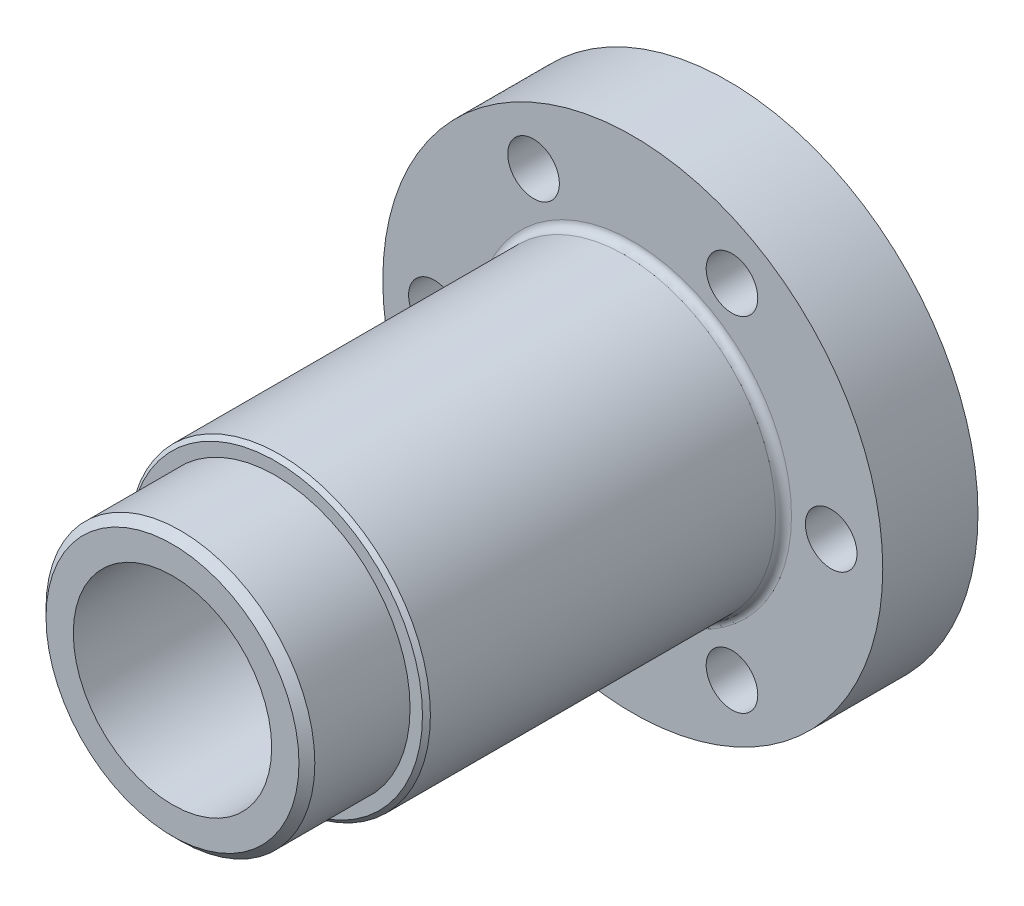
ISO-10303-21;
HEADER;
FILE_DESCRIPTION(('STEP AP214'),'2;1');
FILE_NAME('part.step','',(''),(''),'','','');
FILE_SCHEMA(('AUTOMOTIVE_DESIGN { 1 0 10303 214 1 1 1 1 }'));
ENDSEC;
DATA;
#1=APPLICATION_CONTEXT('core data for automotive mechanical design processes');
#2=APPLICATION_PROTOCOL_DEFINITION('international standard','automotive_design',2000,#1);
#3=PRODUCT_CONTEXT('',#1,'mechanical');
#4=PRODUCT('Part','Part','',(#3));
#5=PRODUCT_RELATED_PRODUCT_CATEGORY('part','',(#4));
#6=PRODUCT_DEFINITION_FORMATION('','',#4);
#7=PRODUCT_DEFINITION_CONTEXT('part definition',#1,'design');
#8=PRODUCT_DEFINITION('design','',#6,#7);
#9=PRODUCT_DEFINITION_SHAPE('','',#8);
#10=(LENGTH_UNIT() NAMED_UNIT(*) SI_UNIT(.MILLI.,.METRE.));
#11=(NAMED_UNIT(*) PLANE_ANGLE_UNIT() SI_UNIT($,.RADIAN.));
#12=(NAMED_UNIT(*) SI_UNIT($,.STERADIAN.) SOLID_ANGLE_UNIT());
#13=UNCERTAINTY_MEASURE_WITH_UNIT(LENGTH_MEASURE(1.E-05),#10,'distance_accuracy_value','');
#14=(GEOMETRIC_REPRESENTATION_CONTEXT(3) GLOBAL_UNCERTAINTY_ASSIGNED_CONTEXT((#13)) GLOBAL_UNIT_ASSIGNED_CONTEXT((#10,
#11,#12)) REPRESENTATION_CONTEXT('',''));
#15=CARTESIAN_POINT('',(0.,0.,0.));
#16=DIRECTION('',(0.,0.,1.));
#17=DIRECTION('',(1.,0.,0.));
#18=AXIS2_PLACEMENT_3D('',#15,#16,#17);
#19=CARTESIAN_POINT('',(0.,0.,57.));
#20=DIRECTION('',(0.,0.,1.));
#21=DIRECTION('',(1.,0.,0.));
#22=AXIS2_PLACEMENT_3D('',#19,#20,#21);
#23=PLANE('',#22);
#24=CARTESIAN_POINT('',(0.,0.,57.));
#25=DIRECTION('',(0.,0.,1.));
#26=DIRECTION('',(1.,0.,0.));
#27=AXIS2_PLACEMENT_3D('',#24,#25,#26);
#28=CIRCLE('',#27,18.5000000000001);
#29=CARTESIAN_POINT('',(18.5000000000001,0.,57.));
#30=VERTEX_POINT('',#29);
#31=EDGE_CURVE('E107',#30,#30,#28,.T.);
#32=ORIENTED_EDGE('',*,*,#31,.T.);
#33=EDGE_LOOP('',(#32));
#34=FACE_BOUND('',#33,.T.);
#35=CARTESIAN_POINT('',(0.,0.,57.));
#36=DIRECTION('',(0.,0.,1.));
#37=DIRECTION('',(1.,0.,0.));
#38=AXIS2_PLACEMENT_3D('',#35,#36,#37);
#39=CIRCLE('',#38,16.9375);
#40=CARTESIAN_POINT('',(16.9375,0.,57.));
#41=VERTEX_POINT('',#40);
#42=EDGE_CURVE('E54',#41,#41,#39,.T.);
#43=ORIENTED_EDGE('',*,*,#42,.F.);
#44=EDGE_LOOP('',(#43));
#45=FACE_BOUND('',#44,.T.);
#46=ADVANCED_FACE('F35',(#34,#45),#23,.T.);
#47=CARTESIAN_POINT('',(0.,0.,12.));
#48=DIRECTION('',(0.,0.,1.));
#49=DIRECTION('',(1.,0.,0.));
#50=AXIS2_PLACEMENT_3D('',#47,#48,#49);
#51=PLANE('',#50);
#52=CARTESIAN_POINT('',(0.,0.,12.));
#53=DIRECTION('',(0.,0.,1.));
#54=DIRECTION('',(1.,0.,0.));
#55=AXIS2_PLACEMENT_3D('',#52,#53,#54);
#56=CIRCLE('',#55,20.);
#57=CARTESIAN_POINT('',(20.,0.,12.));
#58=VERTEX_POINT('',#57);
#59=EDGE_CURVE('E116',#58,#58,#56,.F.);
#60=ORIENTED_EDGE('',*,*,#59,.T.);
#61=EDGE_LOOP('',(#60));
#62=FACE_BOUND('',#61,.T.);
#63=CARTESIAN_POINT('',(0.,0.,12.));
#64=DIRECTION('',(0.,0.,1.));
#65=DIRECTION('',(1.,0.,0.));
#66=AXIS2_PLACEMENT_3D('',#63,#64,#65);
#67=CIRCLE('',#66,31.5);
#68=CARTESIAN_POINT('',(31.5,0.,12.));
#69=VERTEX_POINT('',#68);
#70=EDGE_CURVE('E99',#69,#69,#67,.T.);
#71=ORIENTED_EDGE('',*,*,#70,.T.);
#72=EDGE_LOOP('',(#71));
#73=FACE_BOUND('',#72,.T.);
#74=CARTESIAN_POINT('',(12.5000000000001,21.6506350946123,12.));
#75=DIRECTION('',(0.,0.,1.));
#76=DIRECTION('',(1.,0.,0.));
#77=AXIS2_PLACEMENT_3D('',#74,#75,#76);
#78=CIRCLE('',#77,3.25);
#79=CARTESIAN_POINT('',(15.7500000000001,21.6506350946123,12.));
#80=VERTEX_POINT('',#79);
#81=EDGE_CURVE('E92',#80,#80,#78,.T.);
#82=ORIENTED_EDGE('',*,*,#81,.F.);
#83=EDGE_LOOP('',(#82));
#84=FACE_BOUND('',#83,.T.);
#85=CARTESIAN_POINT('',(25.0000000000012,1.9798051400989E-12,12.));
#86=DIRECTION('',(0.,0.,1.));
#87=DIRECTION('',(1.,0.,0.));
#88=AXIS2_PLACEMENT_3D('',#85,#86,#87);
#89=CIRCLE('',#88,3.25);
#90=CARTESIAN_POINT('',(28.2500000000012,1.9798051400989E-12,12.));
#91=VERTEX_POINT('',#90);
#92=EDGE_CURVE('E86',#91,#91,#89,.T.);
#93=ORIENTED_EDGE('',*,*,#92,.F.);
#94=EDGE_LOOP('',(#93));
#95=FACE_BOUND('',#94,.T.);
#96=CARTESIAN_POINT('',(12.5000000000023,-21.6506350946096,12.));
#97=DIRECTION('',(0.,0.,1.));
#98=DIRECTION('',(1.,0.,0.));
#99=AXIS2_PLACEMENT_3D('',#96,#97,#98);
#100=CIRCLE('',#99,3.25);
#101=CARTESIAN_POINT('',(15.7500000000023,-21.6506350946096,12.));
#102=VERTEX_POINT('',#101);
#103=EDGE_CURVE('E80',#102,#102,#100,.T.);
#104=ORIENTED_EDGE('',*,*,#103,.F.);
#105=EDGE_LOOP('',(#104));
#106=FACE_BOUND('',#105,.T.);
#107=CARTESIAN_POINT('',(-12.4999999999977,-21.6506350946109,12.));
#108=DIRECTION('',(0.,0.,1.));
#109=DIRECTION('',(1.,0.,0.));
#110=AXIS2_PLACEMENT_3D('',#107,#108,#109);
#111=CIRCLE('',#110,3.25);
#112=CARTESIAN_POINT('',(-9.24999999999767,-21.6506350946109,12.));
#113=VERTEX_POINT('',#112);
#114=EDGE_CURVE('E74',#113,#113,#111,.T.);
#115=ORIENTED_EDGE('',*,*,#114,.F.);
#116=EDGE_LOOP('',(#115));
#117=FACE_BOUND('',#116,.T.);
#118=CARTESIAN_POINT('',(-24.9999999999988,-5.57995744016358E-13,12.));
#119=DIRECTION('',(0.,0.,1.));
#120=DIRECTION('',(1.,0.,0.));
#121=AXIS2_PLACEMENT_3D('',#118,#119,#120);
#122=CIRCLE('',#121,3.25);
#123=CARTESIAN_POINT('',(-21.7499999999988,-5.57995744016358E-13,12.));
#124=VERTEX_POINT('',#123);
#125=EDGE_CURVE('E68',#124,#124,#122,.T.);
#126=ORIENTED_EDGE('',*,*,#125,.F.);
#127=EDGE_LOOP('',(#126));
#128=FACE_BOUND('',#127,.T.);
#129=CARTESIAN_POINT('',(-12.4999999999999,21.650635094611,12.));
#130=DIRECTION('',(0.,0.,1.));
#131=DIRECTION('',(1.,0.,0.));
#132=AXIS2_PLACEMENT_3D('',#129,#130,#131);
#133=CIRCLE('',#132,3.25);
#134=CARTESIAN_POINT('',(-9.24999999999988,21.650635094611,12.));
#135=VERTEX_POINT('',#134);
#136=EDGE_CURVE('E58',#135,#135,#133,.T.);
#137=ORIENTED_EDGE('',*,*,#136,.F.);
#138=EDGE_LOOP('',(#137));
#139=FACE_BOUND('',#138,.T.);
#140=ADVANCED_FACE('F139',(#62,#73,#84,#95,#106,#117,#128,#139),#51,.T.);
#141=CARTESIAN_POINT('',(0.,0.,0.));
#142=DIRECTION('',(0.,0.,1.));
#143=DIRECTION('',(1.,0.,0.));
#144=AXIS2_PLACEMENT_3D('',#141,#142,#143);
#145=PLANE('',#144);
#146=CARTESIAN_POINT('',(-12.4999999999999,21.650635094611,0.));
#147=DIRECTION('',(0.,0.,1.));
#148=DIRECTION('',(1.,0.,0.));
#149=AXIS2_PLACEMENT_3D('',#146,#147,#148);
#150=CIRCLE('',#149,3.25);
#151=CARTESIAN_POINT('',(-9.24999999999988,21.650635094611,0.));
#152=VERTEX_POINT('',#151);
#153=EDGE_CURVE('E65',#152,#152,#150,.T.);
#154=ORIENTED_EDGE('',*,*,#153,.T.);
#155=EDGE_LOOP('',(#154));
#156=FACE_BOUND('',#155,.T.);
#157=CARTESIAN_POINT('',(-24.9999999999988,-5.57995744016358E-13,0.));
#158=DIRECTION('',(0.,0.,1.));
#159=DIRECTION('',(1.,0.,0.));
#160=AXIS2_PLACEMENT_3D('',#157,#158,#159);
#161=CIRCLE('',#160,3.25);
#162=CARTESIAN_POINT('',(-21.7499999999988,-5.57995744016358E-13,0.));
#163=VERTEX_POINT('',#162);
#164=EDGE_CURVE('E71',#163,#163,#161,.T.);
#165=ORIENTED_EDGE('',*,*,#164,.T.);
#166=EDGE_LOOP('',(#165));
#167=FACE_BOUND('',#166,.T.);
#168=CARTESIAN_POINT('',(-12.4999999999977,-21.6506350946109,0.));
#169=DIRECTION('',(0.,0.,1.));
#170=DIRECTION('',(1.,0.,0.));
#171=AXIS2_PLACEMENT_3D('',#168,#169,#170);
#172=CIRCLE('',#171,3.25);
#173=CARTESIAN_POINT('',(-9.24999999999767,-21.6506350946109,0.));
#174=VERTEX_POINT('',#173);
#175=EDGE_CURVE('E77',#174,#174,#172,.T.);
#176=ORIENTED_EDGE('',*,*,#175,.T.);
#177=EDGE_LOOP('',(#176));
#178=FACE_BOUND('',#177,.T.);
#179=CARTESIAN_POINT('',(12.5000000000023,-21.6506350946096,0.));
#180=DIRECTION('',(0.,0.,1.));
#181=DIRECTION('',(1.,0.,0.));
#182=AXIS2_PLACEMENT_3D('',#179,#180,#181);
#183=CIRCLE('',#182,3.25);
#184=CARTESIAN_POINT('',(15.7500000000023,-21.6506350946096,0.));
#185=VERTEX_POINT('',#184);
#186=EDGE_CURVE('E83',#185,#185,#183,.T.);
#187=ORIENTED_EDGE('',*,*,#186,.T.);
#188=EDGE_LOOP('',(#187));
#189=FACE_BOUND('',#188,.T.);
#190=CARTESIAN_POINT('',(25.0000000000012,1.9798051400989E-12,0.));
#191=DIRECTION('',(0.,0.,1.));
#192=DIRECTION('',(1.,0.,0.));
#193=AXIS2_PLACEMENT_3D('',#190,#191,#192);
#194=CIRCLE('',#193,3.25);
#195=CARTESIAN_POINT('',(28.2500000000012,1.9798051400989E-12,0.));
#196=VERTEX_POINT('',#195);
#197=EDGE_CURVE('E89',#196,#196,#194,.T.);
#198=ORIENTED_EDGE('',*,*,#197,.T.);
#199=EDGE_LOOP('',(#198));
#200=FACE_BOUND('',#199,.T.);
#201=CARTESIAN_POINT('',(12.5000000000001,21.6506350946123,0.));
#202=DIRECTION('',(0.,0.,1.));
#203=DIRECTION('',(1.,0.,0.));
#204=AXIS2_PLACEMENT_3D('',#201,#202,#203);
#205=CIRCLE('',#204,3.25);
#206=CARTESIAN_POINT('',(15.7500000000001,21.6506350946123,0.));
#207=VERTEX_POINT('',#206);
#208=EDGE_CURVE('E95',#207,#207,#205,.T.);
#209=ORIENTED_EDGE('',*,*,#208,.T.);
#210=EDGE_LOOP('',(#209));
#211=FACE_BOUND('',#210,.T.);
#212=CARTESIAN_POINT('',(0.,0.,0.));
#213=DIRECTION('',(0.,0.,1.));
#214=DIRECTION('',(1.,0.,0.));
#215=AXIS2_PLACEMENT_3D('',#212,#213,#214);
#216=CIRCLE('',#215,31.5);
#217=CARTESIAN_POINT('',(31.5,0.,0.));
#218=VERTEX_POINT('',#217);
#219=EDGE_CURVE('E98',#218,#218,#216,.T.);
#220=ORIENTED_EDGE('',*,*,#219,.F.);
#221=EDGE_LOOP('',(#220));
#222=FACE_BOUND('',#221,.T.);
#223=CARTESIAN_POINT('',(0.,0.,0.));
#224=DIRECTION('',(0.,0.,1.));
#225=DIRECTION('',(1.,0.,0.));
#226=AXIS2_PLACEMENT_3D('',#223,#224,#225);
#227=CIRCLE('',#226,15.75);
#228=CARTESIAN_POINT('',(15.75,0.,0.));
#229=VERTEX_POINT('',#228);
#230=EDGE_CURVE('E102',#229,#229,#227,.F.);
#231=ORIENTED_EDGE('',*,*,#230,.F.);
#232=EDGE_LOOP('',(#231));
#233=FACE_BOUND('',#232,.T.);
#234=ADVANCED_FACE('F145',(#156,#167,#178,#189,#200,#211,#222,#233),#145,.F.);
#235=CARTESIAN_POINT('',(0.,0.,12.));
#236=DIRECTION('',(0.,0.,-1.));
#237=DIRECTION('',(-1.,0.,0.));
#238=AXIS2_PLACEMENT_3D('',#235,#236,#237);
#239=CYLINDRICAL_SURFACE('',#238,31.5);
#240=ORIENTED_EDGE('',*,*,#70,.F.);
#241=EDGE_LOOP('',(#240));
#242=FACE_BOUND('',#241,.T.);
#243=ORIENTED_EDGE('',*,*,#219,.T.);
#244=EDGE_LOOP('',(#243));
#245=FACE_BOUND('',#244,.T.);
#246=ADVANCED_FACE('F186',(#242,#245),#239,.T.);
#247=CARTESIAN_POINT('',(0.,0.,-6.));
#248=DIRECTION('',(0.,0.,1.));
#249=DIRECTION('',(1.,0.,0.));
#250=AXIS2_PLACEMENT_3D('',#247,#248,#249);
#251=CYLINDRICAL_SURFACE('',#250,15.75);
#252=CARTESIAN_POINT('',(0.,0.,-5.50000000000002));
#253=DIRECTION('',(0.,0.,-1.));
#254=DIRECTION('',(-1.,0.,0.));
#255=AXIS2_PLACEMENT_3D('',#252,#253,#254);
#256=CIRCLE('',#255,15.75);
#257=CARTESIAN_POINT('',(-15.75,0.,-5.50000000000002));
#258=VERTEX_POINT('',#257);
#259=EDGE_CURVE('E11',#258,#258,#256,.F.);
#260=ORIENTED_EDGE('',*,*,#259,.T.);
#261=EDGE_LOOP('',(#260));
#262=FACE_BOUND('',#261,.T.);
#263=ORIENTED_EDGE('',*,*,#230,.T.);
#264=EDGE_LOOP('',(#263));
#265=FACE_BOUND('',#264,.T.);
#266=ADVANCED_FACE('F184',(#262,#265),#251,.T.);
#267=CARTESIAN_POINT('',(0.,0.,-6.));
#268=DIRECTION('',(0.,0.,-1.));
#269=DIRECTION('',(-1.,0.,0.));
#270=AXIS2_PLACEMENT_3D('',#267,#268,#269);
#271=PLANE('',#270);
#272=CARTESIAN_POINT('',(0.,0.,-6.));
#273=DIRECTION('',(0.,0.,-1.));
#274=DIRECTION('',(-1.,0.,0.));
#275=AXIS2_PLACEMENT_3D('',#272,#273,#274);
#276=CIRCLE('',#275,15.25);
#277=CARTESIAN_POINT('',(-15.25,0.,-6.));
#278=VERTEX_POINT('',#277);
#279=EDGE_CURVE('E42',#278,#278,#276,.T.);
#280=ORIENTED_EDGE('',*,*,#279,.T.);
#281=EDGE_LOOP('',(#280));
#282=FACE_BOUND('',#281,.T.);
#283=ADVANCED_FACE('F127',(#282),#271,.T.);
#284=CARTESIAN_POINT('',(12.5000000000001,21.6506350946123,12.));
#285=DIRECTION('',(0.,0.,1.));
#286=DIRECTION('',(1.,0.,0.));
#287=AXIS2_PLACEMENT_3D('',#284,#285,#286);
#288=CYLINDRICAL_SURFACE('',#287,3.25);
#289=ORIENTED_EDGE('',*,*,#81,.T.);
#290=EDGE_LOOP('',(#289));
#291=FACE_BOUND('',#290,.T.);
#292=ORIENTED_EDGE('',*,*,#208,.F.);
#293=EDGE_LOOP('',(#292));
#294=FACE_BOUND('',#293,.T.);
#295=ADVANCED_FACE('F177',(#291,#294),#288,.F.);
#296=CARTESIAN_POINT('',(25.0000000000012,1.9798051400989E-12,12.));
#297=DIRECTION('',(0.,0.,1.));
#298=DIRECTION('',(1.,0.,0.));
#299=AXIS2_PLACEMENT_3D('',#296,#297,#298);
#300=CYLINDRICAL_SURFACE('',#299,3.25);
#301=ORIENTED_EDGE('',*,*,#92,.T.);
#302=EDGE_LOOP('',(#301));
#303=FACE_BOUND('',#302,.T.);
#304=ORIENTED_EDGE('',*,*,#197,.F.);
#305=EDGE_LOOP('',(#304));
#306=FACE_BOUND('',#305,.T.);
#307=ADVANCED_FACE('F173',(#303,#306),#300,.F.);
#308=CARTESIAN_POINT('',(12.5000000000023,-21.6506350946096,12.));
#309=DIRECTION('',(0.,0.,1.));
#310=DIRECTION('',(1.,0.,0.));
#311=AXIS2_PLACEMENT_3D('',#308,#309,#310);
#312=CYLINDRICAL_SURFACE('',#311,3.25);
#313=ORIENTED_EDGE('',*,*,#103,.T.);
#314=EDGE_LOOP('',(#313));
#315=FACE_BOUND('',#314,.T.);
#316=ORIENTED_EDGE('',*,*,#186,.F.);
#317=EDGE_LOOP('',(#316));
#318=FACE_BOUND('',#317,.T.);
#319=ADVANCED_FACE('F169',(#315,#318),#312,.F.);
#320=CARTESIAN_POINT('',(-12.4999999999977,-21.6506350946109,12.));
#321=DIRECTION('',(0.,0.,1.));
#322=DIRECTION('',(1.,0.,0.));
#323=AXIS2_PLACEMENT_3D('',#320,#321,#322);
#324=CYLINDRICAL_SURFACE('',#323,3.25);
#325=ORIENTED_EDGE('',*,*,#114,.T.);
#326=EDGE_LOOP('',(#325));
#327=FACE_BOUND('',#326,.T.);
#328=ORIENTED_EDGE('',*,*,#175,.F.);
#329=EDGE_LOOP('',(#328));
#330=FACE_BOUND('',#329,.T.);
#331=ADVANCED_FACE('F165',(#327,#330),#324,.F.);
#332=CARTESIAN_POINT('',(-24.9999999999988,-5.57995744016358E-13,12.));
#333=DIRECTION('',(0.,0.,1.));
#334=DIRECTION('',(1.,0.,0.));
#335=AXIS2_PLACEMENT_3D('',#332,#333,#334);
#336=CYLINDRICAL_SURFACE('',#335,3.25);
#337=ORIENTED_EDGE('',*,*,#125,.T.);
#338=EDGE_LOOP('',(#337));
#339=FACE_BOUND('',#338,.T.);
#340=ORIENTED_EDGE('',*,*,#164,.F.);
#341=EDGE_LOOP('',(#340));
#342=FACE_BOUND('',#341,.T.);
#343=ADVANCED_FACE('F161',(#339,#342),#336,.F.);
#344=CARTESIAN_POINT('',(-12.4999999999999,21.650635094611,12.));
#345=DIRECTION('',(0.,0.,1.));
#346=DIRECTION('',(1.,0.,0.));
#347=AXIS2_PLACEMENT_3D('',#344,#345,#346);
#348=CYLINDRICAL_SURFACE('',#347,3.25);
#349=ORIENTED_EDGE('',*,*,#136,.T.);
#350=EDGE_LOOP('',(#349));
#351=FACE_BOUND('',#350,.T.);
#352=ORIENTED_EDGE('',*,*,#153,.F.);
#353=EDGE_LOOP('',(#352));
#354=FACE_BOUND('',#353,.T.);
#355=ADVANCED_FACE('F157',(#351,#354),#348,.F.);
#356=CARTESIAN_POINT('',(0.,0.,57.));
#357=DIRECTION('',(0.,0.,-1.));
#358=DIRECTION('',(-1.,0.,0.));
#359=AXIS2_PLACEMENT_3D('',#356,#357,#358);
#360=CYLINDRICAL_SURFACE('',#359,19.);
#361=CARTESIAN_POINT('',(0.,0.,13.));
#362=DIRECTION('',(0.,0.,1.));
#363=DIRECTION('',(1.,0.,0.));
#364=AXIS2_PLACEMENT_3D('',#361,#362,#363);
#365=CIRCLE('',#364,19.);
#366=CARTESIAN_POINT('',(19.,0.,13.));
#367=VERTEX_POINT('',#366);
#368=EDGE_CURVE('E113',#367,#367,#365,.T.);
#369=ORIENTED_EDGE('',*,*,#368,.T.);
#370=EDGE_LOOP('',(#369));
#371=FACE_BOUND('',#370,.T.);
#372=CARTESIAN_POINT('',(0.,0.,56.5000000000001));
#373=DIRECTION('',(0.,0.,1.));
#374=DIRECTION('',(1.,0.,0.));
#375=AXIS2_PLACEMENT_3D('',#372,#373,#374);
#376=CIRCLE('',#375,19.);
#377=CARTESIAN_POINT('',(19.,0.,56.5000000000001));
#378=VERTEX_POINT('',#377);
#379=EDGE_CURVE('E110',#378,#378,#376,.F.);
#380=ORIENTED_EDGE('',*,*,#379,.T.);
#381=EDGE_LOOP('',(#380));
#382=FACE_BOUND('',#381,.T.);
#383=ADVANCED_FACE('F153',(#371,#382),#360,.T.);
#384=CARTESIAN_POINT('',(0.,0.,57.));
#385=DIRECTION('',(0.,0.,-1.));
#386=DIRECTION('',(-1.,0.,0.));
#387=AXIS2_PLACEMENT_3D('',#384,#385,#386);
#388=CONICAL_SURFACE('',#387,18.5000000000001,0.785398163397448);
#389=ORIENTED_EDGE('',*,*,#379,.F.);
#390=EDGE_LOOP('',(#389));
#391=FACE_BOUND('',#390,.T.);
#392=ORIENTED_EDGE('',*,*,#31,.F.);
#393=EDGE_LOOP('',(#392));
#394=FACE_BOUND('',#393,.T.);
#395=ADVANCED_FACE('F156',(#391,#394),#388,.T.);
#396=CARTESIAN_POINT('',(0.,0.,13.));
#397=DIRECTION('',(0.,0.,1.));
#398=DIRECTION('',(1.,0.,0.));
#399=AXIS2_PLACEMENT_3D('',#396,#397,#398);
#400=TOROIDAL_SURFACE('',#399,20.,1.);
#401=ORIENTED_EDGE('',*,*,#59,.F.);
#402=EDGE_LOOP('',(#401));
#403=FACE_BOUND('',#402,.T.);
#404=ORIENTED_EDGE('',*,*,#368,.F.);
#405=EDGE_LOOP('',(#404));
#406=FACE_BOUND('',#405,.T.);
#407=ADVANCED_FACE('F197',(#403,#406),#400,.F.);
#408=CARTESIAN_POINT('',(0.,0.,70.));
#409=DIRECTION('',(0.,0.,-1.));
#410=DIRECTION('',(-1.,0.,0.));
#411=AXIS2_PLACEMENT_3D('',#408,#409,#410);
#412=CYLINDRICAL_SURFACE('',#411,16.9375);
#413=CARTESIAN_POINT('',(0.,0.,69.));
#414=DIRECTION('',(0.,0.,1.));
#415=DIRECTION('',(1.,0.,0.));
#416=AXIS2_PLACEMENT_3D('',#413,#414,#415);
#417=CIRCLE('',#416,16.9375);
#418=CARTESIAN_POINT('',(16.9375,0.,69.));
#419=VERTEX_POINT('',#418);
#420=EDGE_CURVE('E122',#419,#419,#417,.F.);
#421=ORIENTED_EDGE('',*,*,#420,.T.);
#422=EDGE_LOOP('',(#421));
#423=FACE_BOUND('',#422,.T.);
#424=ORIENTED_EDGE('',*,*,#42,.T.);
#425=EDGE_LOOP('',(#424));
#426=FACE_BOUND('',#425,.T.);
#427=ADVANCED_FACE('F151',(#423,#426),#412,.T.);
#428=CARTESIAN_POINT('',(0.,0.,70.));
#429=DIRECTION('',(0.,0.,1.));
#430=DIRECTION('',(1.,0.,0.));
#431=AXIS2_PLACEMENT_3D('',#428,#429,#430);
#432=PLANE('',#431);
#433=CARTESIAN_POINT('',(0.,0.,70.));
#434=DIRECTION('',(0.,0.,1.));
#435=DIRECTION('',(1.,0.,0.));
#436=AXIS2_PLACEMENT_3D('',#433,#434,#435);
#437=CIRCLE('',#436,12.5);
#438=CARTESIAN_POINT('',(12.5,0.,70.));
#439=VERTEX_POINT('',#438);
#440=EDGE_CURVE('E55',#439,#439,#437,.T.);
#441=ORIENTED_EDGE('',*,*,#440,.F.);
#442=EDGE_LOOP('',(#441));
#443=FACE_BOUND('',#442,.T.);
#444=CARTESIAN_POINT('',(0.,0.,70.));
#445=DIRECTION('',(0.,0.,1.));
#446=DIRECTION('',(1.,0.,0.));
#447=AXIS2_PLACEMENT_3D('',#444,#445,#446);
#448=CIRCLE('',#447,15.9375);
#449=CARTESIAN_POINT('',(15.9375,0.,70.));
#450=VERTEX_POINT('',#449);
#451=EDGE_CURVE('E119',#450,#450,#448,.T.);
#452=ORIENTED_EDGE('',*,*,#451,.T.);
#453=EDGE_LOOP('',(#452));
#454=FACE_BOUND('',#453,.T.);
#455=ADVANCED_FACE('F135',(#443,#454),#432,.T.);
#456=CARTESIAN_POINT('',(0.,0.,70.));
#457=DIRECTION('',(0.,0.,-1.));
#458=DIRECTION('',(-1.,0.,0.));
#459=AXIS2_PLACEMENT_3D('',#456,#457,#458);
#460=CONICAL_SURFACE('',#459,15.9375,0.785398163397445);
#461=ORIENTED_EDGE('',*,*,#420,.F.);
#462=EDGE_LOOP('',(#461));
#463=FACE_BOUND('',#462,.T.);
#464=ORIENTED_EDGE('',*,*,#451,.F.);
#465=EDGE_LOOP('',(#464));
#466=FACE_BOUND('',#465,.T.);
#467=ADVANCED_FACE('F130',(#463,#466),#460,.T.);
#468=CARTESIAN_POINT('',(0.,0.,-6.));
#469=DIRECTION('',(0.,0.,1.));
#470=DIRECTION('',(1.,0.,0.));
#471=AXIS2_PLACEMENT_3D('',#468,#469,#470);
#472=CONICAL_SURFACE('',#471,15.25,0.785398163397452);
#473=ORIENTED_EDGE('',*,*,#259,.F.);
#474=EDGE_LOOP('',(#473));
#475=FACE_BOUND('',#474,.T.);
#476=ORIENTED_EDGE('',*,*,#279,.F.);
#477=EDGE_LOOP('',(#476));
#478=FACE_BOUND('',#477,.T.);
#479=ADVANCED_FACE('F37',(#475,#478),#472,.T.);
#480=CARTESIAN_POINT('',(0.,0.,25.));
#481=DIRECTION('',(0.,0.,1.));
#482=DIRECTION('',(1.,0.,0.));
#483=AXIS2_PLACEMENT_3D('',#480,#481,#482);
#484=CONICAL_SURFACE('',#483,12.5,1.02974425867665);
#485=CARTESIAN_POINT('',(0.,0.,17.4892422621555));
#486=VERTEX_POINT('',#485);
#487=VERTEX_LOOP('',#486);
#488=FACE_BOUND('',#487,.T.);
#489=CARTESIAN_POINT('',(0.,0.,25.));
#490=DIRECTION('',(0.,0.,1.));
#491=DIRECTION('',(1.,0.,0.));
#492=AXIS2_PLACEMENT_3D('',#489,#490,#491);
#493=CIRCLE('',#492,12.5);
#494=CARTESIAN_POINT('',(12.5,0.,25.));
#495=VERTEX_POINT('',#494);
#496=EDGE_CURVE('E52',#495,#495,#493,.T.);
#497=ORIENTED_EDGE('',*,*,#496,.T.);
#498=EDGE_LOOP('',(#497));
#499=FACE_BOUND('',#498,.T.);
#500=ADVANCED_FACE('F45',(#488,#499),#484,.F.);
#501=CARTESIAN_POINT('',(0.,0.,70.));
#502=DIRECTION('',(0.,0.,1.));
#503=DIRECTION('',(1.,0.,0.));
#504=AXIS2_PLACEMENT_3D('',#501,#502,#503);
#505=CYLINDRICAL_SURFACE('',#504,12.5);
#506=ORIENTED_EDGE('',*,*,#496,.F.);
#507=EDGE_LOOP('',(#506));
#508=FACE_BOUND('',#507,.T.);
#509=ORIENTED_EDGE('',*,*,#440,.T.);
#510=EDGE_LOOP('',(#509));
#511=FACE_BOUND('',#510,.T.);
#512=ADVANCED_FACE('F48',(#508,#511),#505,.F.);
#513=CLOSED_SHELL('',(#46,#140,#234,#246,#266,#283,#295,#307,#319,#331,#343,#355,#383,#395,#407,
#427,#455,#467,#479,#500,#512));
#514=MANIFOLD_SOLID_BREP('B2',#513);
#515=ADVANCED_BREP_SHAPE_REPRESENTATION('',(#18,#514),#14);
#516=SHAPE_DEFINITION_REPRESENTATION(#9,#515);
ENDSEC;
END-ISO-10303-21;
